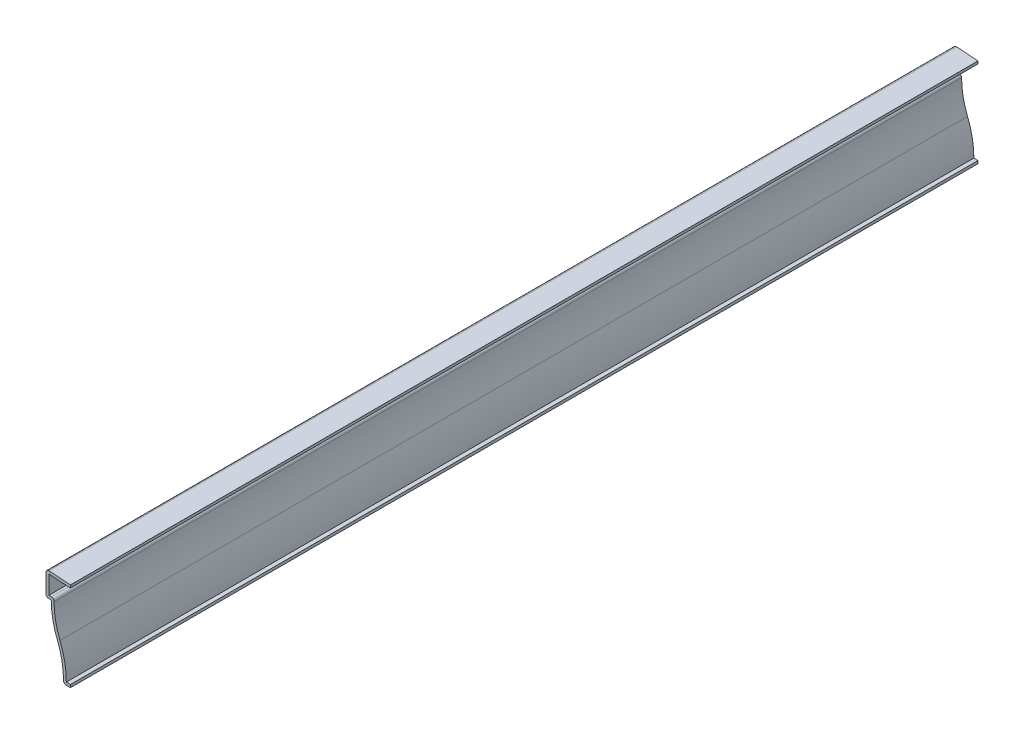
ISO-10303-21;
HEADER;
FILE_DESCRIPTION(('STEP AP214'),'2;1');
FILE_NAME('part.step','',(''),(''),'','','');
FILE_SCHEMA(('AUTOMOTIVE_DESIGN { 1 0 10303 214 1 1 1 1 }'));
ENDSEC;
DATA;
#1=APPLICATION_CONTEXT('core data for automotive mechanical design processes');
#2=APPLICATION_PROTOCOL_DEFINITION('international standard','automotive_design',2000,#1);
#3=PRODUCT_CONTEXT('',#1,'mechanical');
#4=PRODUCT('Part','Part','',(#3));
#5=PRODUCT_RELATED_PRODUCT_CATEGORY('part','',(#4));
#6=PRODUCT_DEFINITION_FORMATION('','',#4);
#7=PRODUCT_DEFINITION_CONTEXT('part definition',#1,'design');
#8=PRODUCT_DEFINITION('design','',#6,#7);
#9=PRODUCT_DEFINITION_SHAPE('','',#8);
#10=(LENGTH_UNIT() NAMED_UNIT(*) SI_UNIT(.MILLI.,.METRE.));
#11=(NAMED_UNIT(*) PLANE_ANGLE_UNIT() SI_UNIT($,.RADIAN.));
#12=(NAMED_UNIT(*) SI_UNIT($,.STERADIAN.) SOLID_ANGLE_UNIT());
#13=UNCERTAINTY_MEASURE_WITH_UNIT(LENGTH_MEASURE(1.E-05),#10,'distance_accuracy_value','');
#14=(GEOMETRIC_REPRESENTATION_CONTEXT(3) GLOBAL_UNCERTAINTY_ASSIGNED_CONTEXT((#13)) GLOBAL_UNIT_ASSIGNED_CONTEXT((#10,
#11,#12)) REPRESENTATION_CONTEXT('',''));
#15=CARTESIAN_POINT('',(0.,0.,0.));
#16=DIRECTION('',(0.,0.,1.));
#17=DIRECTION('',(1.,0.,0.));
#18=AXIS2_PLACEMENT_3D('',#15,#16,#17);
#19=CARTESIAN_POINT('',(-11.2029837534846,40.008227451215,-412.75));
#20=DIRECTION('',(-0.0712470499879099,-0.997458699830735,0.));
#21=DIRECTION('',(0.997458699830735,-0.0712470499879099,0.));
#22=AXIS2_PLACEMENT_3D('',#19,#20,#21);
#23=PLANE('',#22);
#24=DIRECTION('',(0.997458699830735,-0.0712470499879099,0.));
#25=VECTOR('',#24,1.);
#26=CARTESIAN_POINT('',(-11.2029837534846,40.008227451215,0.));
#27=LINE('',#26,#25);
#28=CARTESIAN_POINT('',(-9.8425,39.9110500402518,0.));
#29=VERTEX_POINT('',#28);
#30=CARTESIAN_POINT('',(-0.0904837534846433,39.214477451215,0.));
#31=VERTEX_POINT('',#30);
#32=EDGE_CURVE('E218',#29,#31,#27,.T.);
#33=ORIENTED_EDGE('',*,*,#32,.F.);
#34=DIRECTION('',(0.,0.,1.));
#35=VECTOR('',#34,1.);
#36=CARTESIAN_POINT('',(-9.8425,39.9110500402518,-412.75));
#37=LINE('',#36,#35);
#38=CARTESIAN_POINT('',(-9.8425,39.9110500402518,-412.75));
#39=VERTEX_POINT('',#38);
#40=EDGE_CURVE('E185',#39,#29,#37,.T.);
#41=ORIENTED_EDGE('',*,*,#40,.F.);
#42=DIRECTION('',(0.997458699830735,-0.0712470499879099,0.));
#43=VECTOR('',#42,1.);
#44=CARTESIAN_POINT('',(-11.2029837534846,40.008227451215,-412.75));
#45=LINE('',#44,#43);
#46=CARTESIAN_POINT('',(-0.0904837534846433,39.214477451215,-412.75));
#47=VERTEX_POINT('',#46);
#48=EDGE_CURVE('E167',#39,#47,#45,.T.);
#49=ORIENTED_EDGE('',*,*,#48,.T.);
#50=DIRECTION('',(0.,0.,1.));
#51=VECTOR('',#50,1.);
#52=CARTESIAN_POINT('',(-0.0904837534846433,39.214477451215,-412.75));
#53=LINE('',#52,#51);
#54=EDGE_CURVE('E175',#47,#31,#53,.T.);
#55=ORIENTED_EDGE('',*,*,#54,.T.);
#56=EDGE_LOOP('',(#33,#41,#49,#55));
#57=FACE_BOUND('',#56,.T.);
#58=ADVANCED_FACE('F35',(#57),#23,.T.);
#59=CARTESIAN_POINT('',(-9.8425,30.1625,-412.75));
#60=DIRECTION('',(1.,0.,0.));
#61=DIRECTION('',(0.,0.,-1.));
#62=AXIS2_PLACEMENT_3D('',#59,#60,#61);
#63=PLANE('',#62);
#64=DIRECTION('',(0.,1.,0.));
#65=VECTOR('',#64,1.);
#66=CARTESIAN_POINT('',(-9.8425,30.1625,0.));
#67=LINE('',#66,#65);
#68=CARTESIAN_POINT('',(-9.8425,31.4325,0.));
#69=VERTEX_POINT('',#68);
#70=EDGE_CURVE('E186',#69,#29,#67,.T.);
#71=ORIENTED_EDGE('',*,*,#70,.F.);
#72=DIRECTION('',(0.,0.,1.));
#73=VECTOR('',#72,1.);
#74=CARTESIAN_POINT('',(-9.8425,31.4325,-412.75));
#75=LINE('',#74,#73);
#76=CARTESIAN_POINT('',(-9.8425,31.4325,-412.75));
#77=VERTEX_POINT('',#76);
#78=EDGE_CURVE('E249',#77,#69,#75,.T.);
#79=ORIENTED_EDGE('',*,*,#78,.F.);
#80=DIRECTION('',(0.,1.,0.));
#81=VECTOR('',#80,1.);
#82=CARTESIAN_POINT('',(-9.8425,30.1625,-412.75));
#83=LINE('',#82,#81);
#84=EDGE_CURVE('E183',#77,#39,#83,.T.);
#85=ORIENTED_EDGE('',*,*,#84,.T.);
#86=ORIENTED_EDGE('',*,*,#40,.T.);
#87=EDGE_LOOP('',(#71,#79,#85,#86));
#88=FACE_BOUND('',#87,.T.);
#89=ADVANCED_FACE('F320',(#88),#63,.T.);
#90=CARTESIAN_POINT('',(-8.73125,31.4325,-412.75));
#91=DIRECTION('',(0.,1.,0.));
#92=DIRECTION('',(-1.,0.,0.));
#93=AXIS2_PLACEMENT_3D('',#90,#91,#92);
#94=PLANE('',#93);
#95=DIRECTION('',(-1.,0.,0.));
#96=VECTOR('',#95,1.);
#97=CARTESIAN_POINT('',(-8.73125,31.4325,0.));
#98=LINE('',#97,#96);
#99=CARTESIAN_POINT('',(-8.73125,31.4325,0.));
#100=VERTEX_POINT('',#99);
#101=EDGE_CURVE('E189',#100,#69,#98,.T.);
#102=ORIENTED_EDGE('',*,*,#101,.F.);
#103=DIRECTION('',(0.,0.,1.));
#104=VECTOR('',#103,1.);
#105=CARTESIAN_POINT('',(-8.73125,31.4325,-412.75));
#106=LINE('',#105,#104);
#107=CARTESIAN_POINT('',(-8.73125,31.4325,-412.75));
#108=VERTEX_POINT('',#107);
#109=EDGE_CURVE('E290',#100,#108,#106,.F.);
#110=ORIENTED_EDGE('',*,*,#109,.T.);
#111=DIRECTION('',(-1.,0.,0.));
#112=VECTOR('',#111,1.);
#113=CARTESIAN_POINT('',(-8.73125,31.4325,-412.75));
#114=LINE('',#113,#112);
#115=EDGE_CURVE('E215',#108,#77,#114,.T.);
#116=ORIENTED_EDGE('',*,*,#115,.T.);
#117=ORIENTED_EDGE('',*,*,#78,.T.);
#118=EDGE_LOOP('',(#102,#110,#116,#117));
#119=FACE_BOUND('',#118,.T.);
#120=ADVANCED_FACE('F374',(#119),#94,.T.);
#121=CARTESIAN_POINT('',(29.765625,30.1625,-412.75));
#122=DIRECTION('',(0.,0.,1.));
#123=DIRECTION('',(1.,0.,0.));
#124=AXIS2_PLACEMENT_3D('',#121,#122,#123);
#125=CYLINDRICAL_SURFACE('',#124,37.226875);
#126=CARTESIAN_POINT('',(29.765625,30.1625,-412.75));
#127=DIRECTION('',(0.,0.,1.));
#128=DIRECTION('',(1.,0.,0.));
#129=AXIS2_PLACEMENT_3D('',#126,#127,#128);
#130=CIRCLE('',#129,37.226875);
#131=CARTESIAN_POINT('',(-4.76276245654,16.2473757850792,-412.75));
#132=VERTEX_POINT('',#131);
#133=CARTESIAN_POINT('',(-7.46125,30.1625,-412.75));
#134=VERTEX_POINT('',#133);
#135=EDGE_CURVE('E212',#132,#134,#130,.F.);
#136=ORIENTED_EDGE('',*,*,#135,.T.);
#137=DIRECTION('',(0.,0.,1.));
#138=VECTOR('',#137,1.);
#139=CARTESIAN_POINT('',(-7.46125,30.1625,-412.75));
#140=LINE('',#139,#138);
#141=CARTESIAN_POINT('',(-7.46125,30.1625,0.));
#142=VERTEX_POINT('',#141);
#143=EDGE_CURVE('E287',#134,#142,#140,.T.);
#144=ORIENTED_EDGE('',*,*,#143,.T.);
#145=CARTESIAN_POINT('',(29.765625,30.1625,0.));
#146=DIRECTION('',(0.,0.,1.));
#147=DIRECTION('',(1.,0.,0.));
#148=AXIS2_PLACEMENT_3D('',#145,#146,#147);
#149=CIRCLE('',#148,37.226875);
#150=CARTESIAN_POINT('',(-4.76276245654,16.2473757850792,0.));
#151=VERTEX_POINT('',#150);
#152=EDGE_CURVE('E243',#151,#142,#149,.F.);
#153=ORIENTED_EDGE('',*,*,#152,.F.);
#154=DIRECTION('',(0.,0.,1.));
#155=VECTOR('',#154,1.);
#156=CARTESIAN_POINT('',(-4.76276245654,16.2473757850792,-412.75));
#157=LINE('',#156,#155);
#158=EDGE_CURVE('E252',#132,#151,#157,.T.);
#159=ORIENTED_EDGE('',*,*,#158,.F.);
#160=EDGE_LOOP('',(#136,#144,#153,#159));
#161=FACE_BOUND('',#160,.T.);
#162=ADVANCED_FACE('F331',(#161),#125,.F.);
#163=CARTESIAN_POINT('',(-41.6470313600081,1.38281878790357,-412.75));
#164=DIRECTION('',(0.,0.,1.));
#165=DIRECTION('',(1.,0.,0.));
#166=AXIS2_PLACEMENT_3D('',#163,#164,#165);
#167=CYLINDRICAL_SURFACE('',#166,39.766875);
#168=CARTESIAN_POINT('',(-41.6470313600081,1.38281878790357,0.));
#169=DIRECTION('',(0.,0.,1.));
#170=DIRECTION('',(1.,0.,0.));
#171=AXIS2_PLACEMENT_3D('',#168,#169,#170);
#172=CIRCLE('',#171,39.766875);
#173=CARTESIAN_POINT('',(-1.88031639401271,1.27,0.));
#174=VERTEX_POINT('',#173);
#175=EDGE_CURVE('E240',#174,#151,#172,.T.);
#176=ORIENTED_EDGE('',*,*,#175,.F.);
#177=DIRECTION('',(0.,0.,1.));
#178=VECTOR('',#177,1.);
#179=CARTESIAN_POINT('',(-1.88031639401271,1.27,-412.75));
#180=LINE('',#179,#178);
#181=CARTESIAN_POINT('',(-1.88031639401271,1.27,-412.75));
#182=VERTEX_POINT('',#181);
#183=EDGE_CURVE('E254',#182,#174,#180,.T.);
#184=ORIENTED_EDGE('',*,*,#183,.F.);
#185=CARTESIAN_POINT('',(-41.6470313600081,1.38281878790357,-412.75));
#186=DIRECTION('',(0.,0.,1.));
#187=DIRECTION('',(1.,0.,0.));
#188=AXIS2_PLACEMENT_3D('',#185,#186,#187);
#189=CIRCLE('',#188,39.766875);
#190=EDGE_CURVE('E209',#182,#132,#189,.T.);
#191=ORIENTED_EDGE('',*,*,#190,.T.);
#192=ORIENTED_EDGE('',*,*,#158,.T.);
#193=EDGE_LOOP('',(#176,#184,#191,#192));
#194=FACE_BOUND('',#193,.T.);
#195=ADVANCED_FACE('F336',(#194),#167,.T.);
#196=CARTESIAN_POINT('',(0.,1.27,-412.75));
#197=DIRECTION('',(0.,1.,0.));
#198=DIRECTION('',(-1.,0.,0.));
#199=AXIS2_PLACEMENT_3D('',#196,#197,#198);
#200=PLANE('',#199);
#201=DIRECTION('',(-1.,0.,0.));
#202=VECTOR('',#201,1.);
#203=CARTESIAN_POINT('',(0.,1.27,0.));
#204=LINE('',#203,#202);
#205=CARTESIAN_POINT('',(0.,1.27,0.));
#206=VERTEX_POINT('',#205);
#207=EDGE_CURVE('E237',#206,#174,#204,.T.);
#208=ORIENTED_EDGE('',*,*,#207,.F.);
#209=DIRECTION('',(0.,0.,1.));
#210=VECTOR('',#209,1.);
#211=CARTESIAN_POINT('',(0.,1.27,-412.75));
#212=LINE('',#211,#210);
#213=CARTESIAN_POINT('',(0.,1.27,-412.75));
#214=VERTEX_POINT('',#213);
#215=EDGE_CURVE('E256',#214,#206,#212,.T.);
#216=ORIENTED_EDGE('',*,*,#215,.F.);
#217=DIRECTION('',(-1.,0.,0.));
#218=VECTOR('',#217,1.);
#219=CARTESIAN_POINT('',(0.,1.27,-412.75));
#220=LINE('',#219,#218);
#221=EDGE_CURVE('E206',#214,#182,#220,.T.);
#222=ORIENTED_EDGE('',*,*,#221,.T.);
#223=ORIENTED_EDGE('',*,*,#183,.T.);
#224=EDGE_LOOP('',(#208,#216,#222,#223));
#225=FACE_BOUND('',#224,.T.);
#226=ADVANCED_FACE('F340',(#225),#200,.T.);
#227=CARTESIAN_POINT('',(0.,1.27,-412.75));
#228=DIRECTION('',(-1.,0.,0.));
#229=DIRECTION('',(0.,-1.,0.));
#230=AXIS2_PLACEMENT_3D('',#227,#228,#229);
#231=PLANE('',#230);
#232=DIRECTION('',(0.,-1.,0.));
#233=VECTOR('',#232,1.);
#234=CARTESIAN_POINT('',(0.,1.27,0.));
#235=LINE('',#234,#233);
#236=CARTESIAN_POINT('',(0.,0.,0.));
#237=VERTEX_POINT('',#236);
#238=EDGE_CURVE('E235',#206,#237,#235,.T.);
#239=ORIENTED_EDGE('',*,*,#238,.T.);
#240=DIRECTION('',(0.,0.,1.));
#241=VECTOR('',#240,1.);
#242=CARTESIAN_POINT('',(0.,0.,-412.75));
#243=LINE('',#242,#241);
#244=CARTESIAN_POINT('',(0.,0.,-412.75));
#245=VERTEX_POINT('',#244);
#246=EDGE_CURVE('E258',#245,#237,#243,.T.);
#247=ORIENTED_EDGE('',*,*,#246,.F.);
#248=DIRECTION('',(0.,-1.,0.));
#249=VECTOR('',#248,1.);
#250=CARTESIAN_POINT('',(0.,1.27,-412.75));
#251=LINE('',#250,#249);
#252=EDGE_CURVE('E204',#214,#245,#251,.T.);
#253=ORIENTED_EDGE('',*,*,#252,.F.);
#254=ORIENTED_EDGE('',*,*,#215,.T.);
#255=EDGE_LOOP('',(#239,#247,#253,#254));
#256=FACE_BOUND('',#255,.T.);
#257=ADVANCED_FACE('F344',(#256),#231,.F.);
#258=CARTESIAN_POINT('',(0.,0.,-412.75));
#259=DIRECTION('',(0.,1.,0.));
#260=DIRECTION('',(-1.,0.,0.));
#261=AXIS2_PLACEMENT_3D('',#258,#259,#260);
#262=PLANE('',#261);
#263=DIRECTION('',(-1.,0.,0.));
#264=VECTOR('',#263,1.);
#265=CARTESIAN_POINT('',(0.,0.,0.));
#266=LINE('',#265,#264);
#267=CARTESIAN_POINT('',(-1.88031639401271,0.,0.));
#268=VERTEX_POINT('',#267);
#269=EDGE_CURVE('E232',#237,#268,#266,.T.);
#270=ORIENTED_EDGE('',*,*,#269,.T.);
#271=DIRECTION('',(0.,0.,1.));
#272=VECTOR('',#271,1.);
#273=CARTESIAN_POINT('',(-1.88031639401271,0.,-412.75));
#274=LINE('',#273,#272);
#275=CARTESIAN_POINT('',(-1.88031639401271,0.,-412.75));
#276=VERTEX_POINT('',#275);
#277=EDGE_CURVE('E278',#268,#276,#274,.F.);
#278=ORIENTED_EDGE('',*,*,#277,.T.);
#279=DIRECTION('',(-1.,0.,0.));
#280=VECTOR('',#279,1.);
#281=CARTESIAN_POINT('',(0.,0.,-412.75));
#282=LINE('',#281,#280);
#283=EDGE_CURVE('E202',#245,#276,#282,.T.);
#284=ORIENTED_EDGE('',*,*,#283,.F.);
#285=ORIENTED_EDGE('',*,*,#246,.T.);
#286=EDGE_LOOP('',(#270,#278,#284,#285));
#287=FACE_BOUND('',#286,.T.);
#288=ADVANCED_FACE('F367',(#287),#262,.F.);
#289=CARTESIAN_POINT('',(-41.6470313600081,1.38281878790357,-412.75));
#290=DIRECTION('',(0.,0.,1.));
#291=DIRECTION('',(1.,0.,0.));
#292=AXIS2_PLACEMENT_3D('',#289,#290,#291);
#293=CYLINDRICAL_SURFACE('',#292,38.496875);
#294=CARTESIAN_POINT('',(-41.6470313600081,1.38281878790357,-412.75));
#295=DIRECTION('',(0.,0.,1.));
#296=DIRECTION('',(1.,0.,0.));
#297=AXIS2_PLACEMENT_3D('',#294,#295,#296);
#298=CIRCLE('',#297,38.496875);
#299=CARTESIAN_POINT('',(-3.1503112831463,1.27360299522247,-412.75));
#300=VERTEX_POINT('',#299);
#301=CARTESIAN_POINT('',(-5.94070318000406,15.7726593939518,-412.75));
#302=VERTEX_POINT('',#301);
#303=EDGE_CURVE('E200',#300,#302,#298,.T.);
#304=ORIENTED_EDGE('',*,*,#303,.F.);
#305=DIRECTION('',(0.,0.,1.));
#306=VECTOR('',#305,1.);
#307=CARTESIAN_POINT('',(-3.15031128314629,1.27360299522247,-412.75));
#308=LINE('',#307,#306);
#309=CARTESIAN_POINT('',(-3.1503112831463,1.27360299522247,0.));
#310=VERTEX_POINT('',#309);
#311=EDGE_CURVE('E248',#300,#310,#308,.T.);
#312=ORIENTED_EDGE('',*,*,#311,.T.);
#313=CARTESIAN_POINT('',(-41.6470313600081,1.38281878790357,0.));
#314=DIRECTION('',(0.,0.,1.));
#315=DIRECTION('',(1.,0.,0.));
#316=AXIS2_PLACEMENT_3D('',#313,#314,#315);
#317=CIRCLE('',#316,38.496875);
#318=CARTESIAN_POINT('',(-5.94070318000406,15.7726593939518,0.));
#319=VERTEX_POINT('',#318);
#320=EDGE_CURVE('E230',#310,#319,#317,.T.);
#321=ORIENTED_EDGE('',*,*,#320,.T.);
#322=DIRECTION('',(0.,0.,1.));
#323=VECTOR('',#322,1.);
#324=CARTESIAN_POINT('',(-5.94070318000406,15.7726593939518,-412.75));
#325=LINE('',#324,#323);
#326=EDGE_CURVE('E261',#302,#319,#325,.T.);
#327=ORIENTED_EDGE('',*,*,#326,.F.);
#328=EDGE_LOOP('',(#304,#312,#321,#327));
#329=FACE_BOUND('',#328,.T.);
#330=ADVANCED_FACE('F354',(#329),#293,.F.);
#331=CARTESIAN_POINT('',(29.765625,30.1625,-412.75));
#332=DIRECTION('',(0.,0.,1.));
#333=DIRECTION('',(1.,0.,0.));
#334=AXIS2_PLACEMENT_3D('',#331,#332,#333);
#335=CYLINDRICAL_SURFACE('',#334,38.496875);
#336=CARTESIAN_POINT('',(29.765625,30.1625,0.));
#337=DIRECTION('',(0.,0.,-1.));
#338=DIRECTION('',(-1.,0.,0.));
#339=AXIS2_PLACEMENT_3D('',#336,#337,#338);
#340=CIRCLE('',#339,38.496875);
#341=CARTESIAN_POINT('',(-8.73125,30.1625,0.));
#342=VERTEX_POINT('',#341);
#343=EDGE_CURVE('E228',#319,#342,#340,.T.);
#344=ORIENTED_EDGE('',*,*,#343,.T.);
#345=DIRECTION('',(0.,0.,1.));
#346=VECTOR('',#345,1.);
#347=CARTESIAN_POINT('',(-8.73125,30.1625,-412.75));
#348=LINE('',#347,#346);
#349=CARTESIAN_POINT('',(-8.73125,30.1625,-412.75));
#350=VERTEX_POINT('',#349);
#351=EDGE_CURVE('E264',#350,#342,#348,.T.);
#352=ORIENTED_EDGE('',*,*,#351,.F.);
#353=CARTESIAN_POINT('',(29.765625,30.1625,-412.75));
#354=DIRECTION('',(0.,0.,-1.));
#355=DIRECTION('',(-1.,0.,0.));
#356=AXIS2_PLACEMENT_3D('',#353,#354,#355);
#357=CIRCLE('',#356,38.496875);
#358=EDGE_CURVE('E198',#302,#350,#357,.T.);
#359=ORIENTED_EDGE('',*,*,#358,.F.);
#360=ORIENTED_EDGE('',*,*,#326,.T.);
#361=EDGE_LOOP('',(#344,#352,#359,#360));
#362=FACE_BOUND('',#361,.T.);
#363=ADVANCED_FACE('F359',(#362),#335,.T.);
#364=CARTESIAN_POINT('',(-8.73125,30.1625,-412.75));
#365=DIRECTION('',(0.,1.,0.));
#366=DIRECTION('',(-1.,0.,0.));
#367=AXIS2_PLACEMENT_3D('',#364,#365,#366);
#368=PLANE('',#367);
#369=DIRECTION('',(-1.,0.,0.));
#370=VECTOR('',#369,1.);
#371=CARTESIAN_POINT('',(-8.73125,30.1625,0.));
#372=LINE('',#371,#370);
#373=CARTESIAN_POINT('',(-9.8425,30.1625,0.));
#374=VERTEX_POINT('',#373);
#375=EDGE_CURVE('E225',#342,#374,#372,.T.);
#376=ORIENTED_EDGE('',*,*,#375,.T.);
#377=DIRECTION('',(0.,0.,1.));
#378=VECTOR('',#377,1.);
#379=CARTESIAN_POINT('',(-9.8425,30.1625,-412.75));
#380=LINE('',#379,#378);
#381=CARTESIAN_POINT('',(-9.8425,30.1625,-412.75));
#382=VERTEX_POINT('',#381);
#383=EDGE_CURVE('E43',#374,#382,#380,.F.);
#384=ORIENTED_EDGE('',*,*,#383,.T.);
#385=DIRECTION('',(-1.,0.,0.));
#386=VECTOR('',#385,1.);
#387=CARTESIAN_POINT('',(-8.73125,30.1625,-412.75));
#388=LINE('',#387,#386);
#389=EDGE_CURVE('E195',#350,#382,#388,.T.);
#390=ORIENTED_EDGE('',*,*,#389,.F.);
#391=ORIENTED_EDGE('',*,*,#351,.T.);
#392=EDGE_LOOP('',(#376,#384,#390,#391));
#393=FACE_BOUND('',#392,.T.);
#394=ADVANCED_FACE('F298',(#393),#368,.F.);
#395=CARTESIAN_POINT('',(-11.1125,30.1625,-412.75));
#396=DIRECTION('',(1.,0.,0.));
#397=DIRECTION('',(0.,0.,-1.));
#398=AXIS2_PLACEMENT_3D('',#395,#396,#397);
#399=PLANE('',#398);
#400=DIRECTION('',(0.,1.,0.));
#401=VECTOR('',#400,1.);
#402=CARTESIAN_POINT('',(-11.1125,30.1625,-412.75));
#403=LINE('',#402,#401);
#404=CARTESIAN_POINT('',(-11.1125,31.4325,-412.75));
#405=VERTEX_POINT('',#404);
#406=CARTESIAN_POINT('',(-11.1125,39.9110500402518,-412.75));
#407=VERTEX_POINT('',#406);
#408=EDGE_CURVE('E193',#405,#407,#403,.T.);
#409=ORIENTED_EDGE('',*,*,#408,.F.);
#410=DIRECTION('',(0.,0.,1.));
#411=VECTOR('',#410,1.);
#412=CARTESIAN_POINT('',(-11.1125,31.4325,-412.75));
#413=LINE('',#412,#411);
#414=CARTESIAN_POINT('',(-11.1125,31.4325,0.));
#415=VERTEX_POINT('',#414);
#416=EDGE_CURVE('E293',#405,#415,#413,.T.);
#417=ORIENTED_EDGE('',*,*,#416,.T.);
#418=DIRECTION('',(0.,1.,0.));
#419=VECTOR('',#418,1.);
#420=CARTESIAN_POINT('',(-11.1125,30.1625,0.));
#421=LINE('',#420,#419);
#422=CARTESIAN_POINT('',(-11.1125,39.9110500402518,0.));
#423=VERTEX_POINT('',#422);
#424=EDGE_CURVE('E223',#415,#423,#421,.T.);
#425=ORIENTED_EDGE('',*,*,#424,.T.);
#426=DIRECTION('',(0.,0.,1.));
#427=VECTOR('',#426,1.);
#428=CARTESIAN_POINT('',(-11.1125,39.9110500402518,-412.75));
#429=LINE('',#428,#427);
#430=EDGE_CURVE('E58',#423,#407,#429,.F.);
#431=ORIENTED_EDGE('',*,*,#430,.T.);
#432=EDGE_LOOP('',(#409,#417,#425,#431));
#433=FACE_BOUND('',#432,.T.);
#434=ADVANCED_FACE('F307',(#433),#399,.F.);
#435=CARTESIAN_POINT('',(-11.1125,41.275,-412.75));
#436=DIRECTION('',(-0.0712470499879099,-0.997458699830735,0.));
#437=DIRECTION('',(0.997458699830735,-0.0712470499879099,0.));
#438=AXIS2_PLACEMENT_3D('',#435,#436,#437);
#439=PLANE('',#438);
#440=DIRECTION('',(0.997458699830735,-0.0712470499879099,0.));
#441=VECTOR('',#440,1.);
#442=CARTESIAN_POINT('',(-11.1125,41.275,-412.75));
#443=LINE('',#442,#441);
#444=CARTESIAN_POINT('',(-9.75201624651535,41.1778225890368,-412.75));
#445=VERTEX_POINT('',#444);
#446=CARTESIAN_POINT('',(0.,40.48125,-412.75));
#447=VERTEX_POINT('',#446);
#448=EDGE_CURVE('E169',#445,#447,#443,.T.);
#449=ORIENTED_EDGE('',*,*,#448,.F.);
#450=DIRECTION('',(0.,0.,1.));
#451=VECTOR('',#450,1.);
#452=CARTESIAN_POINT('',(-9.75201624651535,41.1778225890368,-412.75));
#453=LINE('',#452,#451);
#454=CARTESIAN_POINT('',(-9.75201624651535,41.1778225890368,0.));
#455=VERTEX_POINT('',#454);
#456=EDGE_CURVE('E11',#445,#455,#453,.T.);
#457=ORIENTED_EDGE('',*,*,#456,.T.);
#458=DIRECTION('',(0.997458699830735,-0.0712470499879099,0.));
#459=VECTOR('',#458,1.);
#460=CARTESIAN_POINT('',(-11.1125,41.275,0.));
#461=LINE('',#460,#459);
#462=CARTESIAN_POINT('',(0.,40.48125,0.));
#463=VERTEX_POINT('',#462);
#464=EDGE_CURVE('E221',#455,#463,#461,.T.);
#465=ORIENTED_EDGE('',*,*,#464,.T.);
#466=DIRECTION('',(0.,0.,1.));
#467=VECTOR('',#466,1.);
#468=CARTESIAN_POINT('',(0.,40.48125,-412.75));
#469=LINE('',#468,#467);
#470=EDGE_CURVE('E182',#447,#463,#469,.T.);
#471=ORIENTED_EDGE('',*,*,#470,.F.);
#472=EDGE_LOOP('',(#449,#457,#465,#471));
#473=FACE_BOUND('',#472,.T.);
#474=ADVANCED_FACE('F315',(#473),#439,.F.);
#475=CARTESIAN_POINT('',(0.,40.48125,-412.75));
#476=DIRECTION('',(-0.997458699830735,0.0712470499879083,0.));
#477=DIRECTION('',(-0.0712470499879083,-0.997458699830735,0.));
#478=AXIS2_PLACEMENT_3D('',#475,#476,#477);
#479=PLANE('',#478);
#480=DIRECTION('',(-0.0712470499879083,-0.997458699830735,0.));
#481=VECTOR('',#480,1.);
#482=CARTESIAN_POINT('',(0.,40.48125,0.));
#483=LINE('',#482,#481);
#484=EDGE_CURVE('E178',#463,#31,#483,.T.);
#485=ORIENTED_EDGE('',*,*,#484,.T.);
#486=ORIENTED_EDGE('',*,*,#54,.F.);
#487=DIRECTION('',(-0.0712470499879083,-0.997458699830735,0.));
#488=VECTOR('',#487,1.);
#489=CARTESIAN_POINT('',(0.,40.48125,-412.75));
#490=LINE('',#489,#488);
#491=EDGE_CURVE('E161',#447,#47,#490,.T.);
#492=ORIENTED_EDGE('',*,*,#491,.F.);
#493=ORIENTED_EDGE('',*,*,#470,.T.);
#494=EDGE_LOOP('',(#485,#486,#492,#493));
#495=FACE_BOUND('',#494,.T.);
#496=ADVANCED_FACE('F176',(#495),#479,.F.);
#497=CARTESIAN_POINT('',(29.765625,30.1625,-412.75));
#498=DIRECTION('',(0.,0.,-1.));
#499=DIRECTION('',(-1.,0.,0.));
#500=AXIS2_PLACEMENT_3D('',#497,#498,#499);
#501=PLANE('',#500);
#502=ORIENTED_EDGE('',*,*,#283,.T.);
#503=CARTESIAN_POINT('',(-1.88031639401271,1.27,-412.75));
#504=DIRECTION('',(0.,0.,-1.));
#505=DIRECTION('',(-1.,0.,0.));
#506=AXIS2_PLACEMENT_3D('',#503,#504,#505);
#507=CIRCLE('',#506,1.27);
#508=EDGE_CURVE('E285',#276,#300,#507,.T.);
#509=ORIENTED_EDGE('',*,*,#508,.T.);
#510=ORIENTED_EDGE('',*,*,#303,.T.);
#511=ORIENTED_EDGE('',*,*,#358,.T.);
#512=ORIENTED_EDGE('',*,*,#389,.T.);
#513=CARTESIAN_POINT('',(-9.8425,31.4325,-412.75));
#514=DIRECTION('',(0.,0.,-1.));
#515=DIRECTION('',(-1.,0.,0.));
#516=AXIS2_PLACEMENT_3D('',#513,#514,#515);
#517=CIRCLE('',#516,1.27);
#518=EDGE_CURVE('E281',#382,#405,#517,.T.);
#519=ORIENTED_EDGE('',*,*,#518,.T.);
#520=ORIENTED_EDGE('',*,*,#408,.T.);
#521=CARTESIAN_POINT('',(-9.8425,39.9110500402518,-412.75));
#522=DIRECTION('',(0.,0.,-1.));
#523=DIRECTION('',(-1.,0.,0.));
#524=AXIS2_PLACEMENT_3D('',#521,#522,#523);
#525=CIRCLE('',#524,1.27);
#526=EDGE_CURVE('E50',#407,#445,#525,.T.);
#527=ORIENTED_EDGE('',*,*,#526,.T.);
#528=ORIENTED_EDGE('',*,*,#448,.T.);
#529=ORIENTED_EDGE('',*,*,#491,.T.);
#530=ORIENTED_EDGE('',*,*,#48,.F.);
#531=ORIENTED_EDGE('',*,*,#84,.F.);
#532=ORIENTED_EDGE('',*,*,#115,.F.);
#533=CARTESIAN_POINT('',(-8.73125,30.1625,-412.75));
#534=DIRECTION('',(0.,0.,-1.));
#535=DIRECTION('',(-1.,0.,0.));
#536=AXIS2_PLACEMENT_3D('',#533,#534,#535);
#537=CIRCLE('',#536,1.27);
#538=EDGE_CURVE('E283',#108,#134,#537,.T.);
#539=ORIENTED_EDGE('',*,*,#538,.T.);
#540=ORIENTED_EDGE('',*,*,#135,.F.);
#541=ORIENTED_EDGE('',*,*,#190,.F.);
#542=ORIENTED_EDGE('',*,*,#221,.F.);
#543=ORIENTED_EDGE('',*,*,#252,.T.);
#544=EDGE_LOOP('',(#502,#509,#510,#511,#512,#519,#520,#527,#528,#529,#530,#531,#532,#539,#540,
#541,#542,#543));
#545=FACE_BOUND('',#544,.T.);
#546=ADVANCED_FACE('F164',(#545),#501,.T.);
#547=CARTESIAN_POINT('',(29.765625,30.1625,0.));
#548=DIRECTION('',(0.,0.,-1.));
#549=DIRECTION('',(-1.,0.,0.));
#550=AXIS2_PLACEMENT_3D('',#547,#548,#549);
#551=PLANE('',#550);
#552=ORIENTED_EDGE('',*,*,#320,.F.);
#553=CARTESIAN_POINT('',(-1.88031639401271,1.27,0.));
#554=DIRECTION('',(0.,0.,-1.));
#555=DIRECTION('',(-1.,0.,0.));
#556=AXIS2_PLACEMENT_3D('',#553,#554,#555);
#557=CIRCLE('',#556,1.27);
#558=EDGE_CURVE('E276',#310,#268,#557,.F.);
#559=ORIENTED_EDGE('',*,*,#558,.T.);
#560=ORIENTED_EDGE('',*,*,#269,.F.);
#561=ORIENTED_EDGE('',*,*,#238,.F.);
#562=ORIENTED_EDGE('',*,*,#207,.T.);
#563=ORIENTED_EDGE('',*,*,#175,.T.);
#564=ORIENTED_EDGE('',*,*,#152,.T.);
#565=CARTESIAN_POINT('',(-8.73125,30.1625,0.));
#566=DIRECTION('',(0.,0.,-1.));
#567=DIRECTION('',(-1.,0.,0.));
#568=AXIS2_PLACEMENT_3D('',#565,#566,#567);
#569=CIRCLE('',#568,1.27);
#570=EDGE_CURVE('E274',#142,#100,#569,.F.);
#571=ORIENTED_EDGE('',*,*,#570,.T.);
#572=ORIENTED_EDGE('',*,*,#101,.T.);
#573=ORIENTED_EDGE('',*,*,#70,.T.);
#574=ORIENTED_EDGE('',*,*,#32,.T.);
#575=ORIENTED_EDGE('',*,*,#484,.F.);
#576=ORIENTED_EDGE('',*,*,#464,.F.);
#577=CARTESIAN_POINT('',(-9.8425,39.9110500402518,0.));
#578=DIRECTION('',(0.,0.,-1.));
#579=DIRECTION('',(-1.,0.,0.));
#580=AXIS2_PLACEMENT_3D('',#577,#578,#579);
#581=CIRCLE('',#580,1.27);
#582=EDGE_CURVE('E270',#455,#423,#581,.F.);
#583=ORIENTED_EDGE('',*,*,#582,.T.);
#584=ORIENTED_EDGE('',*,*,#424,.F.);
#585=CARTESIAN_POINT('',(-9.8425,31.4325,0.));
#586=DIRECTION('',(0.,0.,-1.));
#587=DIRECTION('',(-1.,0.,0.));
#588=AXIS2_PLACEMENT_3D('',#585,#586,#587);
#589=CIRCLE('',#588,1.27);
#590=EDGE_CURVE('E272',#415,#374,#589,.F.);
#591=ORIENTED_EDGE('',*,*,#590,.T.);
#592=ORIENTED_EDGE('',*,*,#375,.F.);
#593=ORIENTED_EDGE('',*,*,#343,.F.);
#594=EDGE_LOOP('',(#552,#559,#560,#561,#562,#563,#564,#571,#572,#573,#574,#575,#576,#583,#584,
#591,#592,#593));
#595=FACE_BOUND('',#594,.T.);
#596=ADVANCED_FACE('F310',(#595),#551,.F.);
#597=CARTESIAN_POINT('',(-1.88031639401271,1.27,-412.75));
#598=DIRECTION('',(0.,0.,1.));
#599=DIRECTION('',(1.,0.,0.));
#600=AXIS2_PLACEMENT_3D('',#597,#598,#599);
#601=CYLINDRICAL_SURFACE('',#600,1.27);
#602=ORIENTED_EDGE('',*,*,#508,.F.);
#603=ORIENTED_EDGE('',*,*,#277,.F.);
#604=ORIENTED_EDGE('',*,*,#558,.F.);
#605=ORIENTED_EDGE('',*,*,#311,.F.);
#606=EDGE_LOOP('',(#602,#603,#604,#605));
#607=FACE_BOUND('',#606,.T.);
#608=ADVANCED_FACE('F352',(#607),#601,.T.);
#609=CARTESIAN_POINT('',(-8.73125,30.1625,-412.75));
#610=DIRECTION('',(0.,0.,1.));
#611=DIRECTION('',(1.,0.,0.));
#612=AXIS2_PLACEMENT_3D('',#609,#610,#611);
#613=CYLINDRICAL_SURFACE('',#612,1.27);
#614=ORIENTED_EDGE('',*,*,#538,.F.);
#615=ORIENTED_EDGE('',*,*,#109,.F.);
#616=ORIENTED_EDGE('',*,*,#570,.F.);
#617=ORIENTED_EDGE('',*,*,#143,.F.);
#618=EDGE_LOOP('',(#614,#615,#616,#617));
#619=FACE_BOUND('',#618,.T.);
#620=ADVANCED_FACE('F328',(#619),#613,.T.);
#621=CARTESIAN_POINT('',(-9.8425,31.4325,-412.75));
#622=DIRECTION('',(0.,0.,1.));
#623=DIRECTION('',(1.,0.,0.));
#624=AXIS2_PLACEMENT_3D('',#621,#622,#623);
#625=CYLINDRICAL_SURFACE('',#624,1.27);
#626=ORIENTED_EDGE('',*,*,#518,.F.);
#627=ORIENTED_EDGE('',*,*,#383,.F.);
#628=ORIENTED_EDGE('',*,*,#590,.F.);
#629=ORIENTED_EDGE('',*,*,#416,.F.);
#630=EDGE_LOOP('',(#626,#627,#628,#629));
#631=FACE_BOUND('',#630,.T.);
#632=ADVANCED_FACE('F305',(#631),#625,.T.);
#633=CARTESIAN_POINT('',(-9.8425,39.9110500402518,-412.75));
#634=DIRECTION('',(0.,0.,1.));
#635=DIRECTION('',(1.,0.,0.));
#636=AXIS2_PLACEMENT_3D('',#633,#634,#635);
#637=CYLINDRICAL_SURFACE('',#636,1.27);
#638=ORIENTED_EDGE('',*,*,#526,.F.);
#639=ORIENTED_EDGE('',*,*,#430,.F.);
#640=ORIENTED_EDGE('',*,*,#582,.F.);
#641=ORIENTED_EDGE('',*,*,#456,.F.);
#642=EDGE_LOOP('',(#638,#639,#640,#641));
#643=FACE_BOUND('',#642,.T.);
#644=ADVANCED_FACE('F37',(#643),#637,.T.);
#645=CLOSED_SHELL('',(#58,#89,#120,#162,#195,#226,#257,#288,#330,#363,#394,#434,#474,#496,#546,
#596,#608,#620,#632,#644));
#646=MANIFOLD_SOLID_BREP('B2',#645);
#647=ADVANCED_BREP_SHAPE_REPRESENTATION('',(#18,#646),#14);
#648=SHAPE_DEFINITION_REPRESENTATION(#9,#647);
ENDSEC;
END-ISO-10303-21;
